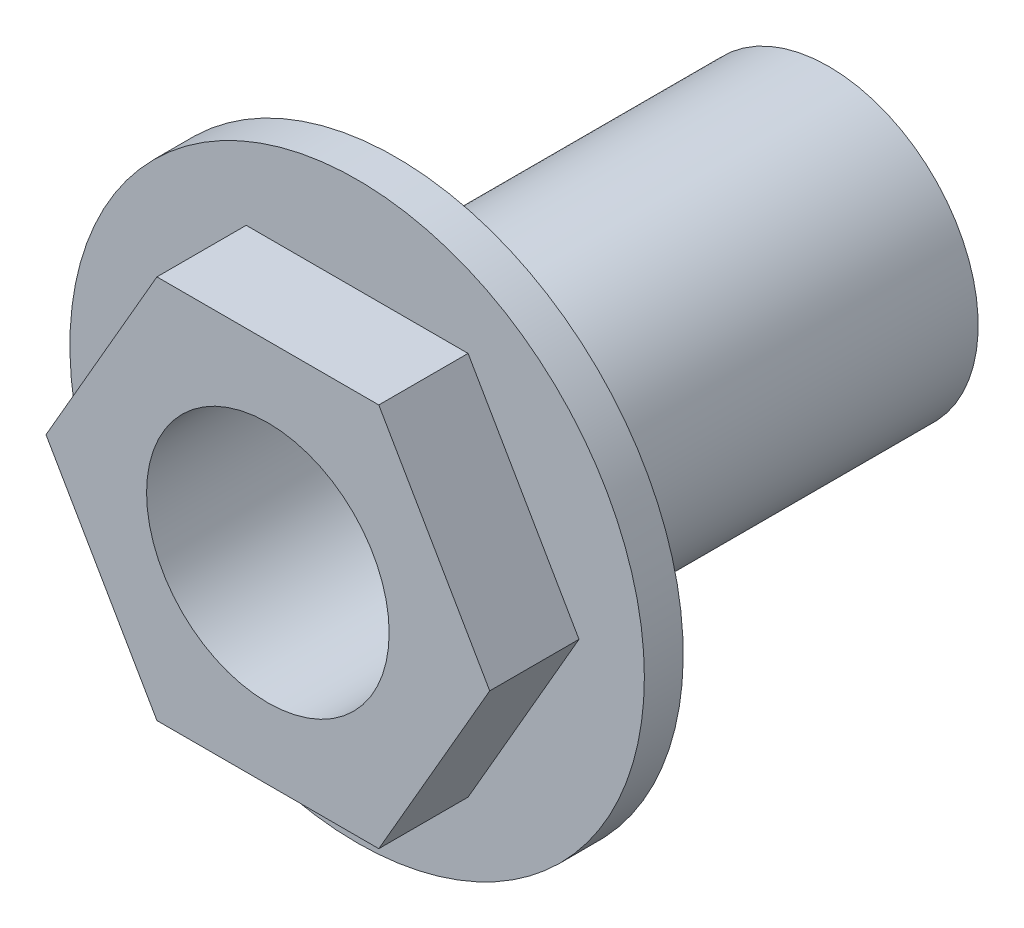
ISO-10303-21;
HEADER;
FILE_DESCRIPTION(('STEP AP214'),'2;1');
FILE_NAME('part.step','',(''),(''),'','','');
FILE_SCHEMA(('AUTOMOTIVE_DESIGN { 1 0 10303 214 1 1 1 1 }'));
ENDSEC;
DATA;
#1=APPLICATION_CONTEXT('core data for automotive mechanical design processes');
#2=APPLICATION_PROTOCOL_DEFINITION('international standard','automotive_design',2000,#1);
#3=PRODUCT_CONTEXT('',#1,'mechanical');
#4=PRODUCT('Part','Part','',(#3));
#5=PRODUCT_RELATED_PRODUCT_CATEGORY('part','',(#4));
#6=PRODUCT_DEFINITION_FORMATION('','',#4);
#7=PRODUCT_DEFINITION_CONTEXT('part definition',#1,'design');
#8=PRODUCT_DEFINITION('design','',#6,#7);
#9=PRODUCT_DEFINITION_SHAPE('','',#8);
#10=(LENGTH_UNIT() NAMED_UNIT(*) SI_UNIT(.MILLI.,.METRE.));
#11=(NAMED_UNIT(*) PLANE_ANGLE_UNIT() SI_UNIT($,.RADIAN.));
#12=(NAMED_UNIT(*) SI_UNIT($,.STERADIAN.) SOLID_ANGLE_UNIT());
#13=UNCERTAINTY_MEASURE_WITH_UNIT(LENGTH_MEASURE(1.E-05),#10,'distance_accuracy_value','');
#14=(GEOMETRIC_REPRESENTATION_CONTEXT(3) GLOBAL_UNCERTAINTY_ASSIGNED_CONTEXT((#13)) GLOBAL_UNIT_ASSIGNED_CONTEXT((#10,
#11,#12)) REPRESENTATION_CONTEXT('',''));
#15=CARTESIAN_POINT('',(0.,0.,0.));
#16=DIRECTION('',(0.,0.,1.));
#17=DIRECTION('',(1.,0.,0.));
#18=AXIS2_PLACEMENT_3D('',#15,#16,#17);
#19=CARTESIAN_POINT('',(0.,0.,12.15));
#20=DIRECTION('',(0.,0.,1.));
#21=DIRECTION('',(1.,0.,0.));
#22=AXIS2_PLACEMENT_3D('',#19,#20,#21);
#23=PLANE('',#22);
#24=CARTESIAN_POINT('',(0.,0.,12.15));
#25=DIRECTION('',(0.,0.,1.));
#26=DIRECTION('',(1.,0.,0.));
#27=AXIS2_PLACEMENT_3D('',#24,#25,#26);
#28=CIRCLE('',#27,7.4);
#29=CARTESIAN_POINT('',(7.4,0.,12.15));
#30=VERTEX_POINT('',#29);
#31=EDGE_CURVE('E11',#30,#30,#28,.T.);
#32=ORIENTED_EDGE('',*,*,#31,.T.);
#33=EDGE_LOOP('',(#32));
#34=FACE_BOUND('',#33,.T.);
#35=DIRECTION('',(0.5,0.866025403784439,0.));
#36=VECTOR('',#35,1.);
#37=CARTESIAN_POINT('',(-5.7157676649773,0.,12.15));
#38=LINE('',#37,#36);
#39=CARTESIAN_POINT('',(-5.7157676649773,0.,12.15));
#40=VERTEX_POINT('',#39);
#41=CARTESIAN_POINT('',(-2.85788383248865,4.95,12.15));
#42=VERTEX_POINT('',#41);
#43=EDGE_CURVE('E26',#40,#42,#38,.T.);
#44=ORIENTED_EDGE('',*,*,#43,.T.);
#45=DIRECTION('',(1.,0.,0.));
#46=VECTOR('',#45,1.);
#47=CARTESIAN_POINT('',(-2.85788383248865,4.95,12.15));
#48=LINE('',#47,#46);
#49=CARTESIAN_POINT('',(2.85788383248864,4.95,12.15));
#50=VERTEX_POINT('',#49);
#51=EDGE_CURVE('E35',#42,#50,#48,.T.);
#52=ORIENTED_EDGE('',*,*,#51,.T.);
#53=DIRECTION('',(0.5,-0.866025403784439,0.));
#54=VECTOR('',#53,1.);
#55=CARTESIAN_POINT('',(2.85788383248864,4.95,12.15));
#56=LINE('',#55,#54);
#57=CARTESIAN_POINT('',(5.71576766497729,0.,12.15));
#58=VERTEX_POINT('',#57);
#59=EDGE_CURVE('E76',#50,#58,#56,.T.);
#60=ORIENTED_EDGE('',*,*,#59,.T.);
#61=DIRECTION('',(-0.5,-0.866025403784439,0.));
#62=VECTOR('',#61,1.);
#63=CARTESIAN_POINT('',(5.71576766497729,0.,12.15));
#64=LINE('',#63,#62);
#65=CARTESIAN_POINT('',(2.85788383248865,-4.95,12.15));
#66=VERTEX_POINT('',#65);
#67=EDGE_CURVE('E264',#58,#66,#64,.T.);
#68=ORIENTED_EDGE('',*,*,#67,.T.);
#69=DIRECTION('',(-1.,0.,0.));
#70=VECTOR('',#69,1.);
#71=CARTESIAN_POINT('',(2.85788383248865,-4.95,12.15));
#72=LINE('',#71,#70);
#73=CARTESIAN_POINT('',(-2.85788383248865,-4.95,12.15));
#74=VERTEX_POINT('',#73);
#75=EDGE_CURVE('E261',#66,#74,#72,.T.);
#76=ORIENTED_EDGE('',*,*,#75,.T.);
#77=DIRECTION('',(-0.5,0.866025403784438,0.));
#78=VECTOR('',#77,1.);
#79=CARTESIAN_POINT('',(-2.85788383248865,-4.95,12.15));
#80=LINE('',#79,#78);
#81=EDGE_CURVE('E258',#74,#40,#80,.T.);
#82=ORIENTED_EDGE('',*,*,#81,.T.);
#83=EDGE_LOOP('',(#44,#52,#60,#68,#76,#82));
#84=FACE_BOUND('',#83,.T.);
#85=ADVANCED_FACE('F16',(#34,#84),#23,.T.);
#86=CARTESIAN_POINT('',(0.,0.,12.15));
#87=DIRECTION('',(0.,0.,-1.));
#88=DIRECTION('',(0.,-1.,0.));
#89=AXIS2_PLACEMENT_3D('',#86,#87,#88);
#90=CYLINDRICAL_SURFACE('',#89,7.4);
#91=CARTESIAN_POINT('',(0.,0.,11.15));
#92=DIRECTION('',(0.,0.,-1.));
#93=DIRECTION('',(0.,-1.,0.));
#94=AXIS2_PLACEMENT_3D('',#91,#92,#93);
#95=CIRCLE('',#94,7.4);
#96=CARTESIAN_POINT('',(0.,-7.4,11.15));
#97=VERTEX_POINT('',#96);
#98=EDGE_CURVE('E254',#97,#97,#95,.T.);
#99=ORIENTED_EDGE('',*,*,#98,.F.);
#100=EDGE_LOOP('',(#99));
#101=FACE_BOUND('',#100,.T.);
#102=ORIENTED_EDGE('',*,*,#31,.F.);
#103=EDGE_LOOP('',(#102));
#104=FACE_BOUND('',#103,.T.);
#105=ADVANCED_FACE('F18',(#101,#104),#90,.T.);
#106=CARTESIAN_POINT('',(0.,0.,11.15));
#107=DIRECTION('',(0.,0.,1.));
#108=DIRECTION('',(1.,0.,0.));
#109=AXIS2_PLACEMENT_3D('',#106,#107,#108);
#110=PLANE('',#109);
#111=CARTESIAN_POINT('',(0.,0.,11.15));
#112=DIRECTION('',(0.,0.,-1.));
#113=DIRECTION('',(0.,-1.,0.));
#114=AXIS2_PLACEMENT_3D('',#111,#112,#113);
#115=CIRCLE('',#114,3.85);
#116=CARTESIAN_POINT('',(0.,-3.85,11.15));
#117=VERTEX_POINT('',#116);
#118=EDGE_CURVE('E79',#117,#117,#115,.T.);
#119=ORIENTED_EDGE('',*,*,#118,.F.);
#120=EDGE_LOOP('',(#119));
#121=FACE_BOUND('',#120,.T.);
#122=ORIENTED_EDGE('',*,*,#98,.T.);
#123=EDGE_LOOP('',(#122));
#124=FACE_BOUND('',#123,.T.);
#125=ADVANCED_FACE('F128',(#121,#124),#110,.F.);
#126=CARTESIAN_POINT('',(-5.7157676649773,0.,14.45));
#127=DIRECTION('',(-0.866025403784439,0.5,0.));
#128=DIRECTION('',(-0.5,-0.866025403784439,0.));
#129=AXIS2_PLACEMENT_3D('',#126,#127,#128);
#130=PLANE('',#129);
#131=DIRECTION('',(0.5,0.866025403784439,0.));
#132=VECTOR('',#131,1.);
#133=CARTESIAN_POINT('',(-5.7157676649773,0.,14.45));
#134=LINE('',#133,#132);
#135=CARTESIAN_POINT('',(-5.7157676649773,0.,14.45));
#136=VERTEX_POINT('',#135);
#137=CARTESIAN_POINT('',(-2.85788383248865,4.95,14.45));
#138=VERTEX_POINT('',#137);
#139=EDGE_CURVE('E252',#136,#138,#134,.T.);
#140=ORIENTED_EDGE('',*,*,#139,.T.);
#141=DIRECTION('',(0.,0.,-1.));
#142=VECTOR('',#141,1.);
#143=CARTESIAN_POINT('',(-2.85788383248865,4.95,14.45));
#144=LINE('',#143,#142);
#145=EDGE_CURVE('E92',#138,#42,#144,.T.);
#146=ORIENTED_EDGE('',*,*,#145,.T.);
#147=ORIENTED_EDGE('',*,*,#43,.F.);
#148=DIRECTION('',(0.,0.,-1.));
#149=VECTOR('',#148,1.);
#150=CARTESIAN_POINT('',(-5.7157676649773,0.,14.45));
#151=LINE('',#150,#149);
#152=EDGE_CURVE('E244',#136,#40,#151,.T.);
#153=ORIENTED_EDGE('',*,*,#152,.F.);
#154=EDGE_LOOP('',(#140,#146,#147,#153));
#155=FACE_BOUND('',#154,.T.);
#156=ADVANCED_FACE('F134',(#155),#130,.T.);
#157=CARTESIAN_POINT('',(-2.85788383248865,-4.95,14.45));
#158=DIRECTION('',(-0.866025403784438,-0.5,0.));
#159=DIRECTION('',(0.5,-0.866025403784438,0.));
#160=AXIS2_PLACEMENT_3D('',#157,#158,#159);
#161=PLANE('',#160);
#162=DIRECTION('',(-0.5,0.866025403784438,0.));
#163=VECTOR('',#162,1.);
#164=CARTESIAN_POINT('',(-2.85788383248865,-4.95,14.45));
#165=LINE('',#164,#163);
#166=CARTESIAN_POINT('',(-2.85788383248865,-4.95,14.45));
#167=VERTEX_POINT('',#166);
#168=EDGE_CURVE('E246',#167,#136,#165,.T.);
#169=ORIENTED_EDGE('',*,*,#168,.T.);
#170=ORIENTED_EDGE('',*,*,#152,.T.);
#171=ORIENTED_EDGE('',*,*,#81,.F.);
#172=DIRECTION('',(0.,0.,-1.));
#173=VECTOR('',#172,1.);
#174=CARTESIAN_POINT('',(-2.85788383248865,-4.95,14.45));
#175=LINE('',#174,#173);
#176=EDGE_CURVE('E236',#167,#74,#175,.T.);
#177=ORIENTED_EDGE('',*,*,#176,.F.);
#178=EDGE_LOOP('',(#169,#170,#171,#177));
#179=FACE_BOUND('',#178,.T.);
#180=ADVANCED_FACE('F138',(#179),#161,.T.);
#181=CARTESIAN_POINT('',(2.85788383248865,-4.95,14.45));
#182=DIRECTION('',(0.,-1.,0.));
#183=DIRECTION('',(1.,0.,0.));
#184=AXIS2_PLACEMENT_3D('',#181,#182,#183);
#185=PLANE('',#184);
#186=DIRECTION('',(-1.,0.,0.));
#187=VECTOR('',#186,1.);
#188=CARTESIAN_POINT('',(2.85788383248865,-4.95,14.45));
#189=LINE('',#188,#187);
#190=CARTESIAN_POINT('',(2.85788383248865,-4.95,14.45));
#191=VERTEX_POINT('',#190);
#192=EDGE_CURVE('E239',#191,#167,#189,.T.);
#193=ORIENTED_EDGE('',*,*,#192,.T.);
#194=ORIENTED_EDGE('',*,*,#176,.T.);
#195=ORIENTED_EDGE('',*,*,#75,.F.);
#196=DIRECTION('',(0.,0.,-1.));
#197=VECTOR('',#196,1.);
#198=CARTESIAN_POINT('',(2.85788383248865,-4.95,14.45));
#199=LINE('',#198,#197);
#200=EDGE_CURVE('E88',#191,#66,#199,.T.);
#201=ORIENTED_EDGE('',*,*,#200,.F.);
#202=EDGE_LOOP('',(#193,#194,#195,#201));
#203=FACE_BOUND('',#202,.T.);
#204=ADVANCED_FACE('F142',(#203),#185,.T.);
#205=CARTESIAN_POINT('',(5.71576766497729,0.,14.45));
#206=DIRECTION('',(0.866025403784439,-0.5,0.));
#207=DIRECTION('',(0.5,0.866025403784439,0.));
#208=AXIS2_PLACEMENT_3D('',#205,#206,#207);
#209=PLANE('',#208);
#210=DIRECTION('',(-0.5,-0.866025403784439,0.));
#211=VECTOR('',#210,1.);
#212=CARTESIAN_POINT('',(5.71576766497729,0.,14.45));
#213=LINE('',#212,#211);
#214=CARTESIAN_POINT('',(5.71576766497729,0.,14.45));
#215=VERTEX_POINT('',#214);
#216=EDGE_CURVE('E87',#215,#191,#213,.T.);
#217=ORIENTED_EDGE('',*,*,#216,.T.);
#218=ORIENTED_EDGE('',*,*,#200,.T.);
#219=ORIENTED_EDGE('',*,*,#67,.F.);
#220=DIRECTION('',(0.,0.,-1.));
#221=VECTOR('',#220,1.);
#222=CARTESIAN_POINT('',(5.71576766497729,0.,14.45));
#223=LINE('',#222,#221);
#224=EDGE_CURVE('E66',#215,#58,#223,.T.);
#225=ORIENTED_EDGE('',*,*,#224,.F.);
#226=EDGE_LOOP('',(#217,#218,#219,#225));
#227=FACE_BOUND('',#226,.T.);
#228=ADVANCED_FACE('F146',(#227),#209,.T.);
#229=CARTESIAN_POINT('',(2.85788383248864,4.95,14.45));
#230=DIRECTION('',(0.866025403784439,0.5,0.));
#231=DIRECTION('',(-0.5,0.866025403784439,0.));
#232=AXIS2_PLACEMENT_3D('',#229,#230,#231);
#233=PLANE('',#232);
#234=DIRECTION('',(0.5,-0.866025403784439,0.));
#235=VECTOR('',#234,1.);
#236=CARTESIAN_POINT('',(2.85788383248864,4.95,14.45));
#237=LINE('',#236,#235);
#238=CARTESIAN_POINT('',(2.85788383248864,4.95,14.45));
#239=VERTEX_POINT('',#238);
#240=EDGE_CURVE('E74',#239,#215,#237,.T.);
#241=ORIENTED_EDGE('',*,*,#240,.T.);
#242=ORIENTED_EDGE('',*,*,#224,.T.);
#243=ORIENTED_EDGE('',*,*,#59,.F.);
#244=DIRECTION('',(0.,0.,-1.));
#245=VECTOR('',#244,1.);
#246=CARTESIAN_POINT('',(2.85788383248864,4.95,14.45));
#247=LINE('',#246,#245);
#248=EDGE_CURVE('E71',#239,#50,#247,.T.);
#249=ORIENTED_EDGE('',*,*,#248,.F.);
#250=EDGE_LOOP('',(#241,#242,#243,#249));
#251=FACE_BOUND('',#250,.T.);
#252=ADVANCED_FACE('F73',(#251),#233,.T.);
#253=CARTESIAN_POINT('',(-2.85788383248865,4.95,14.45));
#254=DIRECTION('',(0.,1.,0.));
#255=DIRECTION('',(-1.,0.,0.));
#256=AXIS2_PLACEMENT_3D('',#253,#254,#255);
#257=PLANE('',#256);
#258=DIRECTION('',(1.,0.,0.));
#259=VECTOR('',#258,1.);
#260=CARTESIAN_POINT('',(-2.85788383248865,4.95,14.45));
#261=LINE('',#260,#259);
#262=EDGE_CURVE('E78',#138,#239,#261,.T.);
#263=ORIENTED_EDGE('',*,*,#262,.T.);
#264=ORIENTED_EDGE('',*,*,#248,.T.);
#265=ORIENTED_EDGE('',*,*,#51,.F.);
#266=ORIENTED_EDGE('',*,*,#145,.F.);
#267=EDGE_LOOP('',(#263,#264,#265,#266));
#268=FACE_BOUND('',#267,.T.);
#269=ADVANCED_FACE('F90',(#268),#257,.T.);
#270=CARTESIAN_POINT('',(0.,0.,0.));
#271=DIRECTION('',(0.,0.,1.));
#272=DIRECTION('',(1.,0.,0.));
#273=AXIS2_PLACEMENT_3D('',#270,#271,#272);
#274=CYLINDRICAL_SURFACE('',#273,3.125);
#275=CARTESIAN_POINT('',(0.,0.,14.45));
#276=DIRECTION('',(0.,0.,-1.));
#277=DIRECTION('',(0.,-1.,0.));
#278=AXIS2_PLACEMENT_3D('',#275,#276,#277);
#279=CIRCLE('',#278,3.125);
#280=CARTESIAN_POINT('',(0.,-3.125,14.45));
#281=VERTEX_POINT('',#280);
#282=EDGE_CURVE('E97',#281,#281,#279,.T.);
#283=ORIENTED_EDGE('',*,*,#282,.F.);
#284=EDGE_LOOP('',(#283));
#285=FACE_BOUND('',#284,.T.);
#286=CARTESIAN_POINT('',(0.,0.,0.));
#287=DIRECTION('',(0.,0.,1.));
#288=DIRECTION('',(1.,0.,0.));
#289=AXIS2_PLACEMENT_3D('',#286,#287,#288);
#290=CIRCLE('',#289,3.125);
#291=CARTESIAN_POINT('',(3.125,0.,0.));
#292=VERTEX_POINT('',#291);
#293=EDGE_CURVE('E99',#292,#292,#290,.T.);
#294=ORIENTED_EDGE('',*,*,#293,.F.);
#295=EDGE_LOOP('',(#294));
#296=FACE_BOUND('',#295,.T.);
#297=ADVANCED_FACE('F110',(#285,#296),#274,.F.);
#298=CARTESIAN_POINT('',(0.,0.,0.));
#299=DIRECTION('',(0.,0.,1.));
#300=DIRECTION('',(1.,0.,0.));
#301=AXIS2_PLACEMENT_3D('',#298,#299,#300);
#302=CYLINDRICAL_SURFACE('',#301,3.85);
#303=ORIENTED_EDGE('',*,*,#118,.T.);
#304=EDGE_LOOP('',(#303));
#305=FACE_BOUND('',#304,.T.);
#306=CARTESIAN_POINT('',(0.,0.,0.));
#307=DIRECTION('',(0.,0.,-1.));
#308=DIRECTION('',(0.,-1.,0.));
#309=AXIS2_PLACEMENT_3D('',#306,#307,#308);
#310=CIRCLE('',#309,3.85);
#311=CARTESIAN_POINT('',(0.,-3.85,0.));
#312=VERTEX_POINT('',#311);
#313=EDGE_CURVE('E20',#312,#312,#310,.T.);
#314=ORIENTED_EDGE('',*,*,#313,.F.);
#315=EDGE_LOOP('',(#314));
#316=FACE_BOUND('',#315,.T.);
#317=ADVANCED_FACE('F108',(#305,#316),#302,.T.);
#318=CARTESIAN_POINT('',(0.,0.,14.45));
#319=DIRECTION('',(0.,0.,1.));
#320=DIRECTION('',(1.,0.,0.));
#321=AXIS2_PLACEMENT_3D('',#318,#319,#320);
#322=PLANE('',#321);
#323=ORIENTED_EDGE('',*,*,#262,.F.);
#324=ORIENTED_EDGE('',*,*,#139,.F.);
#325=ORIENTED_EDGE('',*,*,#168,.F.);
#326=ORIENTED_EDGE('',*,*,#192,.F.);
#327=ORIENTED_EDGE('',*,*,#216,.F.);
#328=ORIENTED_EDGE('',*,*,#240,.F.);
#329=EDGE_LOOP('',(#323,#324,#325,#326,#327,#328));
#330=FACE_BOUND('',#329,.T.);
#331=ORIENTED_EDGE('',*,*,#282,.T.);
#332=EDGE_LOOP('',(#331));
#333=FACE_BOUND('',#332,.T.);
#334=ADVANCED_FACE('F83',(#330,#333),#322,.T.);
#335=CARTESIAN_POINT('',(0.,0.,0.));
#336=DIRECTION('',(0.,0.,1.));
#337=DIRECTION('',(1.,0.,0.));
#338=AXIS2_PLACEMENT_3D('',#335,#336,#337);
#339=PLANE('',#338);
#340=ORIENTED_EDGE('',*,*,#293,.T.);
#341=EDGE_LOOP('',(#340));
#342=FACE_BOUND('',#341,.T.);
#343=ORIENTED_EDGE('',*,*,#313,.T.);
#344=EDGE_LOOP('',(#343));
#345=FACE_BOUND('',#344,.T.);
#346=ADVANCED_FACE('F106',(#342,#345),#339,.F.);
#347=CLOSED_SHELL('',(#85,#105,#125,#156,#180,#204,#228,#252,#269,#297,#317,#334,#346));
#348=MANIFOLD_SOLID_BREP('B1',#347);
#349=ADVANCED_BREP_SHAPE_REPRESENTATION('',(#18,#348),#14);
#350=SHAPE_DEFINITION_REPRESENTATION(#9,#349);
ENDSEC;
END-ISO-10303-21;
